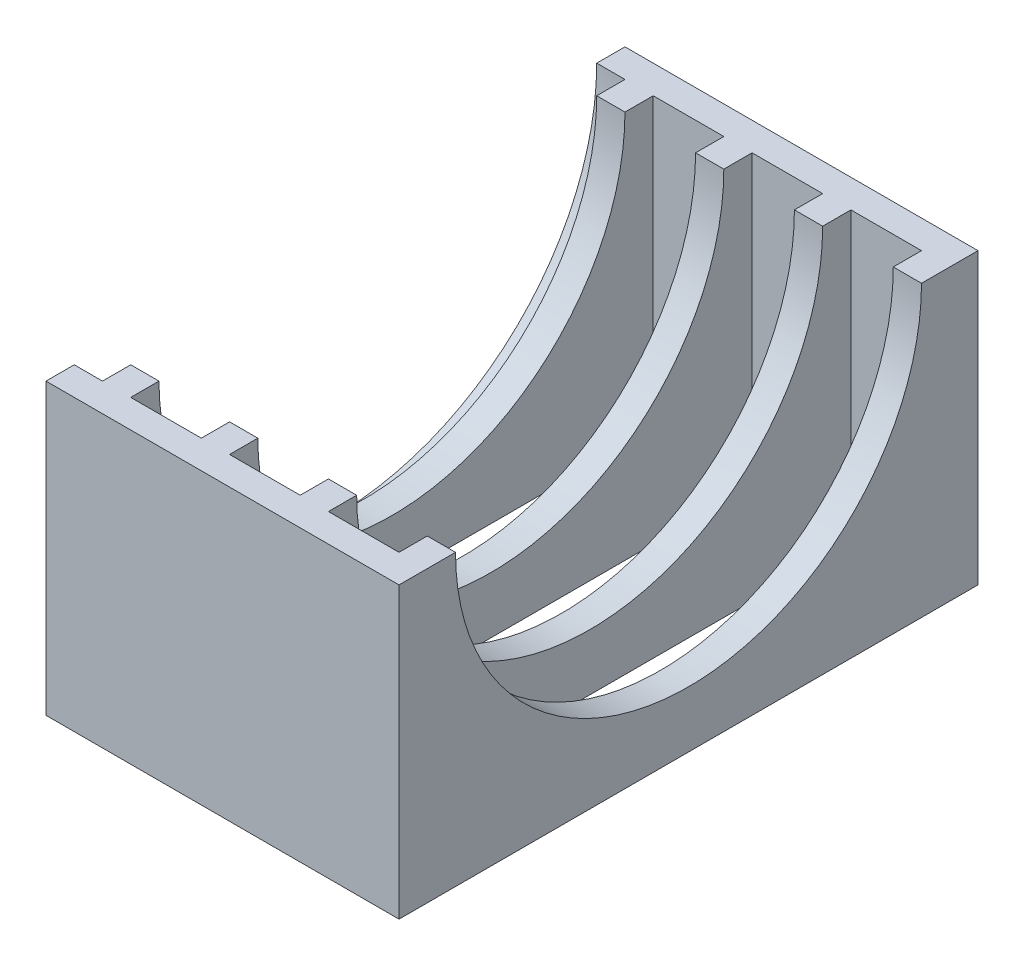
ISO-10303-21;
HEADER;
FILE_DESCRIPTION(('STEP AP214'),'2;1');
FILE_NAME('part.step','',(''),(''),'','','');
FILE_SCHEMA(('AUTOMOTIVE_DESIGN { 1 0 10303 214 1 1 1 1 }'));
ENDSEC;
DATA;
#1=APPLICATION_CONTEXT('core data for automotive mechanical design processes');
#2=APPLICATION_PROTOCOL_DEFINITION('international standard','automotive_design',2000,#1);
#3=PRODUCT_CONTEXT('',#1,'mechanical');
#4=PRODUCT('Part','Part','',(#3));
#5=PRODUCT_RELATED_PRODUCT_CATEGORY('part','',(#4));
#6=PRODUCT_DEFINITION_FORMATION('','',#4);
#7=PRODUCT_DEFINITION_CONTEXT('part definition',#1,'design');
#8=PRODUCT_DEFINITION('design','',#6,#7);
#9=PRODUCT_DEFINITION_SHAPE('','',#8);
#10=(LENGTH_UNIT() NAMED_UNIT(*) SI_UNIT(.MILLI.,.METRE.));
#11=(NAMED_UNIT(*) PLANE_ANGLE_UNIT() SI_UNIT($,.RADIAN.));
#12=(NAMED_UNIT(*) SI_UNIT($,.STERADIAN.) SOLID_ANGLE_UNIT());
#13=UNCERTAINTY_MEASURE_WITH_UNIT(LENGTH_MEASURE(1.E-05),#10,'distance_accuracy_value','');
#14=(GEOMETRIC_REPRESENTATION_CONTEXT(3) GLOBAL_UNCERTAINTY_ASSIGNED_CONTEXT((#13)) GLOBAL_UNIT_ASSIGNED_CONTEXT((#10,
#11,#12)) REPRESENTATION_CONTEXT('',''));
#15=CARTESIAN_POINT('',(0.,0.,0.));
#16=DIRECTION('',(0.,0.,1.));
#17=DIRECTION('',(1.,0.,0.));
#18=AXIS2_PLACEMENT_3D('',#15,#16,#17);
#19=CARTESIAN_POINT('',(0.,20.5,0.));
#20=DIRECTION('',(0.,1.,0.));
#21=DIRECTION('',(0.,0.,1.));
#22=AXIS2_PLACEMENT_3D('',#19,#20,#21);
#23=PLANE('',#22);
#24=DIRECTION('',(1.,0.,0.));
#25=VECTOR('',#24,1.);
#26=CARTESIAN_POINT('',(2.,20.5,-4.));
#27=LINE('',#26,#25);
#28=CARTESIAN_POINT('',(2.,20.5,-4.));
#29=VERTEX_POINT('',#28);
#30=CARTESIAN_POINT('',(4.,20.5,-4.));
#31=VERTEX_POINT('',#30);
#32=EDGE_CURVE('E273',#29,#31,#27,.T.);
#33=ORIENTED_EDGE('',*,*,#32,.F.);
#34=DIRECTION('',(0.,0.,1.));
#35=VECTOR('',#34,1.);
#36=CARTESIAN_POINT('',(2.,20.5,0.));
#37=LINE('',#36,#35);
#38=CARTESIAN_POINT('',(2.,20.5,-2.));
#39=VERTEX_POINT('',#38);
#40=EDGE_CURVE('E378',#29,#39,#37,.T.);
#41=ORIENTED_EDGE('',*,*,#40,.T.);
#42=DIRECTION('',(-1.,0.,0.));
#43=VECTOR('',#42,1.);
#44=CARTESIAN_POINT('',(2.,20.5,-2.));
#45=LINE('',#44,#43);
#46=CARTESIAN_POINT('',(0.,20.5,-2.));
#47=VERTEX_POINT('',#46);
#48=EDGE_CURVE('E382',#47,#39,#45,.F.);
#49=ORIENTED_EDGE('',*,*,#48,.F.);
#50=DIRECTION('',(0.,0.,1.));
#51=VECTOR('',#50,1.);
#52=CARTESIAN_POINT('',(0.,20.5,-41.));
#53=LINE('',#52,#51);
#54=CARTESIAN_POINT('',(0.,20.5,0.));
#55=VERTEX_POINT('',#54);
#56=EDGE_CURVE('E340',#47,#55,#53,.T.);
#57=ORIENTED_EDGE('',*,*,#56,.T.);
#58=DIRECTION('',(1.,0.,0.));
#59=VECTOR('',#58,1.);
#60=CARTESIAN_POINT('',(0.,20.5,0.));
#61=LINE('',#60,#59);
#62=CARTESIAN_POINT('',(25.,20.5,0.));
#63=VERTEX_POINT('',#62);
#64=EDGE_CURVE('E333',#55,#63,#61,.T.);
#65=ORIENTED_EDGE('',*,*,#64,.T.);
#66=DIRECTION('',(0.,0.,-1.));
#67=VECTOR('',#66,1.);
#68=CARTESIAN_POINT('',(25.,20.5,-41.));
#69=LINE('',#68,#67);
#70=CARTESIAN_POINT('',(25.,20.5,-4.));
#71=VERTEX_POINT('',#70);
#72=EDGE_CURVE('E351',#63,#71,#69,.T.);
#73=ORIENTED_EDGE('',*,*,#72,.T.);
#74=CARTESIAN_POINT('',(23.,20.5,-4.));
#75=VERTEX_POINT('',#74);
#76=EDGE_CURVE('E268',#75,#71,#27,.T.);
#77=ORIENTED_EDGE('',*,*,#76,.F.);
#78=DIRECTION('',(0.,0.,1.));
#79=VECTOR('',#78,1.);
#80=CARTESIAN_POINT('',(23.,20.5,0.));
#81=LINE('',#80,#79);
#82=CARTESIAN_POINT('',(23.,20.5,-2.));
#83=VERTEX_POINT('',#82);
#84=EDGE_CURVE('E290',#75,#83,#81,.T.);
#85=ORIENTED_EDGE('',*,*,#84,.T.);
#86=DIRECTION('',(-1.,0.,0.));
#87=VECTOR('',#86,1.);
#88=CARTESIAN_POINT('',(0.,20.5,-2.));
#89=LINE('',#88,#87);
#90=CARTESIAN_POINT('',(18.,20.5,-2.));
#91=VERTEX_POINT('',#90);
#92=EDGE_CURVE('E337',#83,#91,#89,.T.);
#93=ORIENTED_EDGE('',*,*,#92,.T.);
#94=DIRECTION('',(0.,0.,1.));
#95=VECTOR('',#94,1.);
#96=CARTESIAN_POINT('',(18.,20.5,0.));
#97=LINE('',#96,#95);
#98=CARTESIAN_POINT('',(18.,20.5,-4.));
#99=VERTEX_POINT('',#98);
#100=EDGE_CURVE('E299',#99,#91,#97,.T.);
#101=ORIENTED_EDGE('',*,*,#100,.F.);
#102=CARTESIAN_POINT('',(16.,20.5,-4.));
#103=VERTEX_POINT('',#102);
#104=EDGE_CURVE('E274',#103,#99,#27,.T.);
#105=ORIENTED_EDGE('',*,*,#104,.F.);
#106=DIRECTION('',(0.,0.,-1.));
#107=VECTOR('',#106,1.);
#108=CARTESIAN_POINT('',(16.,20.5,0.));
#109=LINE('',#108,#107);
#110=CARTESIAN_POINT('',(16.,20.5,-2.));
#111=VERTEX_POINT('',#110);
#112=EDGE_CURVE('E304',#111,#103,#109,.T.);
#113=ORIENTED_EDGE('',*,*,#112,.F.);
#114=CARTESIAN_POINT('',(11.,20.5,-2.));
#115=VERTEX_POINT('',#114);
#116=EDGE_CURVE('E341',#111,#115,#89,.T.);
#117=ORIENTED_EDGE('',*,*,#116,.T.);
#118=DIRECTION('',(0.,0.,1.));
#119=VECTOR('',#118,1.);
#120=CARTESIAN_POINT('',(11.,20.5,0.));
#121=LINE('',#120,#119);
#122=CARTESIAN_POINT('',(11.,20.5,-4.));
#123=VERTEX_POINT('',#122);
#124=EDGE_CURVE('E217',#123,#115,#121,.T.);
#125=ORIENTED_EDGE('',*,*,#124,.F.);
#126=CARTESIAN_POINT('',(9.00000000000001,20.5,-4.));
#127=VERTEX_POINT('',#126);
#128=EDGE_CURVE('E285',#127,#123,#27,.T.);
#129=ORIENTED_EDGE('',*,*,#128,.F.);
#130=DIRECTION('',(0.,0.,1.));
#131=VECTOR('',#130,1.);
#132=CARTESIAN_POINT('',(9.00000000000001,20.5,0.));
#133=LINE('',#132,#131);
#134=CARTESIAN_POINT('',(9.00000000000001,20.5,-2.));
#135=VERTEX_POINT('',#134);
#136=EDGE_CURVE('E317',#127,#135,#133,.T.);
#137=ORIENTED_EDGE('',*,*,#136,.T.);
#138=CARTESIAN_POINT('',(4.,20.5,-2.));
#139=VERTEX_POINT('',#138);
#140=EDGE_CURVE('E336',#135,#139,#89,.T.);
#141=ORIENTED_EDGE('',*,*,#140,.T.);
#142=DIRECTION('',(0.,0.,1.));
#143=VECTOR('',#142,1.);
#144=CARTESIAN_POINT('',(4.00000000000001,20.5,0.));
#145=LINE('',#144,#143);
#146=EDGE_CURVE('E325',#31,#139,#145,.T.);
#147=ORIENTED_EDGE('',*,*,#146,.F.);
#148=EDGE_LOOP('',(#33,#41,#49,#57,#65,#73,#77,#85,#93,#101,#105,#113,#117,#125,#129,#137,#141,#147));
#149=FACE_BOUND('',#148,.T.);
#150=ADVANCED_FACE('F34',(#149),#23,.T.);
#151=CARTESIAN_POINT('',(0.,20.5,-39.));
#152=DIRECTION('',(0.,0.,-1.));
#153=DIRECTION('',(-1.,0.,0.));
#154=AXIS2_PLACEMENT_3D('',#151,#152,#153);
#155=PLANE('',#154);
#156=DIRECTION('',(0.,-1.,0.));
#157=VECTOR('',#156,1.);
#158=CARTESIAN_POINT('',(23.,20.5,-39.));
#159=LINE('',#158,#157);
#160=CARTESIAN_POINT('',(23.,20.5,-39.));
#161=VERTEX_POINT('',#160);
#162=CARTESIAN_POINT('',(23.,0.,-39.));
#163=VERTEX_POINT('',#162);
#164=EDGE_CURVE('E297',#161,#163,#159,.T.);
#165=ORIENTED_EDGE('',*,*,#164,.F.);
#166=DIRECTION('',(1.,0.,0.));
#167=VECTOR('',#166,1.);
#168=CARTESIAN_POINT('',(0.,20.5,-39.));
#169=LINE('',#168,#167);
#170=CARTESIAN_POINT('',(18.,20.5,-39.));
#171=VERTEX_POINT('',#170);
#172=EDGE_CURVE('E345',#171,#161,#169,.T.);
#173=ORIENTED_EDGE('',*,*,#172,.F.);
#174=DIRECTION('',(0.,-1.,0.));
#175=VECTOR('',#174,1.);
#176=CARTESIAN_POINT('',(18.,20.5,-39.));
#177=LINE('',#176,#175);
#178=CARTESIAN_POINT('',(18.,0.,-39.));
#179=VERTEX_POINT('',#178);
#180=EDGE_CURVE('E312',#171,#179,#177,.T.);
#181=ORIENTED_EDGE('',*,*,#180,.T.);
#182=DIRECTION('',(-1.,0.,0.));
#183=VECTOR('',#182,1.);
#184=CARTESIAN_POINT('',(18.,0.,-39.));
#185=LINE('',#184,#183);
#186=EDGE_CURVE('E233',#163,#179,#185,.T.);
#187=ORIENTED_EDGE('',*,*,#186,.F.);
#188=EDGE_LOOP('',(#165,#173,#181,#187));
#189=FACE_BOUND('',#188,.T.);
#190=ADVANCED_FACE('F454',(#189),#155,.F.);
#191=CARTESIAN_POINT('',(0.,20.5,-2.));
#192=DIRECTION('',(0.,0.,1.));
#193=DIRECTION('',(1.,0.,0.));
#194=AXIS2_PLACEMENT_3D('',#191,#192,#193);
#195=PLANE('',#194);
#196=DIRECTION('',(0.,-1.,0.));
#197=VECTOR('',#196,1.);
#198=CARTESIAN_POINT('',(23.,20.5,-2.));
#199=LINE('',#198,#197);
#200=CARTESIAN_POINT('',(23.,0.,-2.));
#201=VERTEX_POINT('',#200);
#202=EDGE_CURVE('E57',#83,#201,#199,.T.);
#203=ORIENTED_EDGE('',*,*,#202,.T.);
#204=DIRECTION('',(1.,0.,0.));
#205=VECTOR('',#204,1.);
#206=CARTESIAN_POINT('',(18.,0.,-2.));
#207=LINE('',#206,#205);
#208=CARTESIAN_POINT('',(18.,0.,-2.));
#209=VERTEX_POINT('',#208);
#210=EDGE_CURVE('E245',#209,#201,#207,.T.);
#211=ORIENTED_EDGE('',*,*,#210,.F.);
#212=DIRECTION('',(0.,-1.,0.));
#213=VECTOR('',#212,1.);
#214=CARTESIAN_POINT('',(18.,20.5,-2.));
#215=LINE('',#214,#213);
#216=EDGE_CURVE('E307',#91,#209,#215,.T.);
#217=ORIENTED_EDGE('',*,*,#216,.F.);
#218=ORIENTED_EDGE('',*,*,#92,.F.);
#219=EDGE_LOOP('',(#203,#211,#217,#218));
#220=FACE_BOUND('',#219,.T.);
#221=ADVANCED_FACE('F459',(#220),#195,.F.);
#222=DIRECTION('',(0.,-1.,0.));
#223=VECTOR('',#222,1.);
#224=CARTESIAN_POINT('',(9.00000000000001,20.5,-39.));
#225=LINE('',#224,#223);
#226=CARTESIAN_POINT('',(9.00000000000001,20.5,-39.));
#227=VERTEX_POINT('',#226);
#228=CARTESIAN_POINT('',(9.00000000000001,0.,-39.));
#229=VERTEX_POINT('',#228);
#230=EDGE_CURVE('E321',#227,#229,#225,.T.);
#231=ORIENTED_EDGE('',*,*,#230,.F.);
#232=CARTESIAN_POINT('',(4.,20.5,-39.));
#233=VERTEX_POINT('',#232);
#234=EDGE_CURVE('E346',#233,#227,#169,.T.);
#235=ORIENTED_EDGE('',*,*,#234,.F.);
#236=DIRECTION('',(0.,-1.,0.));
#237=VECTOR('',#236,1.);
#238=CARTESIAN_POINT('',(4.,20.5,-39.));
#239=LINE('',#238,#237);
#240=CARTESIAN_POINT('',(4.,0.,-39.));
#241=VERTEX_POINT('',#240);
#242=EDGE_CURVE('E331',#233,#241,#239,.T.);
#243=ORIENTED_EDGE('',*,*,#242,.T.);
#244=DIRECTION('',(-1.,0.,0.));
#245=VECTOR('',#244,1.);
#246=CARTESIAN_POINT('',(4.,0.,-39.));
#247=LINE('',#246,#245);
#248=EDGE_CURVE('E258',#229,#241,#247,.T.);
#249=ORIENTED_EDGE('',*,*,#248,.F.);
#250=EDGE_LOOP('',(#231,#235,#243,#249));
#251=FACE_BOUND('',#250,.T.);
#252=ADVANCED_FACE('F429',(#251),#155,.F.);
#253=DIRECTION('',(0.,-1.,0.));
#254=VECTOR('',#253,1.);
#255=CARTESIAN_POINT('',(9.00000000000001,20.5,-2.));
#256=LINE('',#255,#254);
#257=CARTESIAN_POINT('',(9.00000000000001,0.,-2.));
#258=VERTEX_POINT('',#257);
#259=EDGE_CURVE('E219',#135,#258,#256,.T.);
#260=ORIENTED_EDGE('',*,*,#259,.T.);
#261=DIRECTION('',(1.,0.,0.));
#262=VECTOR('',#261,1.);
#263=CARTESIAN_POINT('',(4.,0.,-2.));
#264=LINE('',#263,#262);
#265=CARTESIAN_POINT('',(4.,0.,-2.));
#266=VERTEX_POINT('',#265);
#267=EDGE_CURVE('E252',#266,#258,#264,.T.);
#268=ORIENTED_EDGE('',*,*,#267,.F.);
#269=DIRECTION('',(0.,-1.,0.));
#270=VECTOR('',#269,1.);
#271=CARTESIAN_POINT('',(4.,20.5,-2.));
#272=LINE('',#271,#270);
#273=EDGE_CURVE('E329',#139,#266,#272,.T.);
#274=ORIENTED_EDGE('',*,*,#273,.F.);
#275=ORIENTED_EDGE('',*,*,#140,.F.);
#276=EDGE_LOOP('',(#260,#268,#274,#275));
#277=FACE_BOUND('',#276,.T.);
#278=ADVANCED_FACE('F469',(#277),#195,.F.);
#279=CARTESIAN_POINT('',(0.,2.,0.));
#280=DIRECTION('',(1.,0.,0.));
#281=DIRECTION('',(0.,0.,-1.));
#282=AXIS2_PLACEMENT_3D('',#279,#280,#281);
#283=PLANE('',#282);
#284=ORIENTED_EDGE('',*,*,#56,.F.);
#285=CARTESIAN_POINT('',(0.,20.5,-20.5));
#286=DIRECTION('',(-1.,0.,0.));
#287=DIRECTION('',(0.,0.,1.));
#288=AXIS2_PLACEMENT_3D('',#285,#286,#287);
#289=CIRCLE('',#288,18.5);
#290=CARTESIAN_POINT('',(0.,20.5,-39.));
#291=VERTEX_POINT('',#290);
#292=EDGE_CURVE('E291',#291,#47,#289,.T.);
#293=ORIENTED_EDGE('',*,*,#292,.F.);
#294=CARTESIAN_POINT('',(0.,20.5,-41.));
#295=VERTEX_POINT('',#294);
#296=EDGE_CURVE('E342',#295,#291,#53,.T.);
#297=ORIENTED_EDGE('',*,*,#296,.F.);
#298=DIRECTION('',(0.,-1.,0.));
#299=VECTOR('',#298,1.);
#300=CARTESIAN_POINT('',(0.,2.,-41.));
#301=LINE('',#300,#299);
#302=CARTESIAN_POINT('',(0.,0.,-41.));
#303=VERTEX_POINT('',#302);
#304=EDGE_CURVE('E366',#295,#303,#301,.T.);
#305=ORIENTED_EDGE('',*,*,#304,.T.);
#306=DIRECTION('',(0.,0.,1.));
#307=VECTOR('',#306,1.);
#308=CARTESIAN_POINT('',(0.,0.,0.));
#309=LINE('',#308,#307);
#310=CARTESIAN_POINT('',(0.,0.,0.));
#311=VERTEX_POINT('',#310);
#312=EDGE_CURVE('E357',#303,#311,#309,.T.);
#313=ORIENTED_EDGE('',*,*,#312,.T.);
#314=DIRECTION('',(0.,-1.,0.));
#315=VECTOR('',#314,1.);
#316=CARTESIAN_POINT('',(0.,2.,0.));
#317=LINE('',#316,#315);
#318=EDGE_CURVE('E375',#55,#311,#317,.T.);
#319=ORIENTED_EDGE('',*,*,#318,.F.);
#320=EDGE_LOOP('',(#284,#293,#297,#305,#313,#319));
#321=FACE_BOUND('',#320,.T.);
#322=ADVANCED_FACE('F36',(#321),#283,.F.);
#323=CARTESIAN_POINT('',(0.,2.,0.));
#324=DIRECTION('',(0.,0.,-1.));
#325=DIRECTION('',(-1.,0.,0.));
#326=AXIS2_PLACEMENT_3D('',#323,#324,#325);
#327=PLANE('',#326);
#328=DIRECTION('',(1.,0.,0.));
#329=VECTOR('',#328,1.);
#330=CARTESIAN_POINT('',(0.,0.,0.));
#331=LINE('',#330,#329);
#332=CARTESIAN_POINT('',(25.,0.,0.));
#333=VERTEX_POINT('',#332);
#334=EDGE_CURVE('E360',#311,#333,#331,.T.);
#335=ORIENTED_EDGE('',*,*,#334,.T.);
#336=DIRECTION('',(0.,-1.,0.));
#337=VECTOR('',#336,1.);
#338=CARTESIAN_POINT('',(25.,2.,0.));
#339=LINE('',#338,#337);
#340=EDGE_CURVE('E372',#63,#333,#339,.T.);
#341=ORIENTED_EDGE('',*,*,#340,.F.);
#342=ORIENTED_EDGE('',*,*,#64,.F.);
#343=ORIENTED_EDGE('',*,*,#318,.T.);
#344=EDGE_LOOP('',(#335,#341,#342,#343));
#345=FACE_BOUND('',#344,.T.);
#346=ADVANCED_FACE('F409',(#345),#327,.F.);
#347=CARTESIAN_POINT('',(25.,2.,0.));
#348=DIRECTION('',(-1.,0.,0.));
#349=DIRECTION('',(0.,0.,1.));
#350=AXIS2_PLACEMENT_3D('',#347,#348,#349);
#351=PLANE('',#350);
#352=CARTESIAN_POINT('',(25.,20.5,-37.));
#353=VERTEX_POINT('',#352);
#354=CARTESIAN_POINT('',(25.,20.5,-41.));
#355=VERTEX_POINT('',#354);
#356=EDGE_CURVE('E349',#353,#355,#69,.T.);
#357=ORIENTED_EDGE('',*,*,#356,.F.);
#358=CARTESIAN_POINT('',(25.,20.5,-20.5));
#359=DIRECTION('',(1.,0.,0.));
#360=DIRECTION('',(0.,0.,-1.));
#361=AXIS2_PLACEMENT_3D('',#358,#359,#360);
#362=CIRCLE('',#361,16.5);
#363=EDGE_CURVE('E261',#71,#353,#362,.T.);
#364=ORIENTED_EDGE('',*,*,#363,.F.);
#365=ORIENTED_EDGE('',*,*,#72,.F.);
#366=ORIENTED_EDGE('',*,*,#340,.T.);
#367=DIRECTION('',(0.,0.,-1.));
#368=VECTOR('',#367,1.);
#369=CARTESIAN_POINT('',(25.,0.,0.));
#370=LINE('',#369,#368);
#371=CARTESIAN_POINT('',(25.,0.,-41.));
#372=VERTEX_POINT('',#371);
#373=EDGE_CURVE('E362',#333,#372,#370,.T.);
#374=ORIENTED_EDGE('',*,*,#373,.T.);
#375=DIRECTION('',(0.,-1.,0.));
#376=VECTOR('',#375,1.);
#377=CARTESIAN_POINT('',(25.,2.,-41.));
#378=LINE('',#377,#376);
#379=EDGE_CURVE('E369',#355,#372,#378,.T.);
#380=ORIENTED_EDGE('',*,*,#379,.F.);
#381=EDGE_LOOP('',(#357,#364,#365,#366,#374,#380));
#382=FACE_BOUND('',#381,.T.);
#383=ADVANCED_FACE('F661',(#382),#351,.F.);
#384=CARTESIAN_POINT('',(0.,2.,-41.));
#385=DIRECTION('',(0.,0.,1.));
#386=DIRECTION('',(1.,0.,0.));
#387=AXIS2_PLACEMENT_3D('',#384,#385,#386);
#388=PLANE('',#387);
#389=DIRECTION('',(-1.,0.,0.));
#390=VECTOR('',#389,1.);
#391=CARTESIAN_POINT('',(0.,0.,-41.));
#392=LINE('',#391,#390);
#393=EDGE_CURVE('E364',#372,#303,#392,.T.);
#394=ORIENTED_EDGE('',*,*,#393,.T.);
#395=ORIENTED_EDGE('',*,*,#304,.F.);
#396=DIRECTION('',(-1.,0.,0.));
#397=VECTOR('',#396,1.);
#398=CARTESIAN_POINT('',(0.,20.5,-41.));
#399=LINE('',#398,#397);
#400=EDGE_CURVE('E354',#355,#295,#399,.T.);
#401=ORIENTED_EDGE('',*,*,#400,.F.);
#402=ORIENTED_EDGE('',*,*,#379,.T.);
#403=EDGE_LOOP('',(#394,#395,#401,#402));
#404=FACE_BOUND('',#403,.T.);
#405=ADVANCED_FACE('F401',(#404),#388,.F.);
#406=CARTESIAN_POINT('',(0.,0.,0.));
#407=DIRECTION('',(0.,-1.,0.));
#408=DIRECTION('',(0.,0.,-1.));
#409=AXIS2_PLACEMENT_3D('',#406,#407,#408);
#410=PLANE('',#409);
#411=DIRECTION('',(0.,0.,1.));
#412=VECTOR('',#411,1.);
#413=CARTESIAN_POINT('',(11.,0.,-39.));
#414=LINE('',#413,#412);
#415=CARTESIAN_POINT('',(11.,0.,-39.));
#416=VERTEX_POINT('',#415);
#417=CARTESIAN_POINT('',(11.,0.,-2.));
#418=VERTEX_POINT('',#417);
#419=EDGE_CURVE('E214',#416,#418,#414,.T.);
#420=ORIENTED_EDGE('',*,*,#419,.T.);
#421=DIRECTION('',(1.,0.,0.));
#422=VECTOR('',#421,1.);
#423=CARTESIAN_POINT('',(11.,0.,-2.));
#424=LINE('',#423,#422);
#425=CARTESIAN_POINT('',(16.,0.,-2.));
#426=VERTEX_POINT('',#425);
#427=EDGE_CURVE('E223',#418,#426,#424,.T.);
#428=ORIENTED_EDGE('',*,*,#427,.T.);
#429=DIRECTION('',(0.,0.,-1.));
#430=VECTOR('',#429,1.);
#431=CARTESIAN_POINT('',(16.,0.,-39.));
#432=LINE('',#431,#430);
#433=CARTESIAN_POINT('',(16.,0.,-39.));
#434=VERTEX_POINT('',#433);
#435=EDGE_CURVE('E227',#426,#434,#432,.T.);
#436=ORIENTED_EDGE('',*,*,#435,.T.);
#437=DIRECTION('',(-1.,0.,0.));
#438=VECTOR('',#437,1.);
#439=CARTESIAN_POINT('',(11.,0.,-39.));
#440=LINE('',#439,#438);
#441=EDGE_CURVE('E232',#434,#416,#440,.T.);
#442=ORIENTED_EDGE('',*,*,#441,.T.);
#443=EDGE_LOOP('',(#420,#428,#436,#442));
#444=FACE_BOUND('',#443,.T.);
#445=DIRECTION('',(0.,0.,1.));
#446=VECTOR('',#445,1.);
#447=CARTESIAN_POINT('',(18.,0.,-39.));
#448=LINE('',#447,#446);
#449=EDGE_CURVE('E242',#179,#209,#448,.T.);
#450=ORIENTED_EDGE('',*,*,#449,.T.);
#451=ORIENTED_EDGE('',*,*,#210,.T.);
#452=DIRECTION('',(0.,0.,-1.));
#453=VECTOR('',#452,1.);
#454=CARTESIAN_POINT('',(23.,0.,-39.));
#455=LINE('',#454,#453);
#456=EDGE_CURVE('E236',#201,#163,#455,.T.);
#457=ORIENTED_EDGE('',*,*,#456,.T.);
#458=ORIENTED_EDGE('',*,*,#186,.T.);
#459=EDGE_LOOP('',(#450,#451,#457,#458));
#460=FACE_BOUND('',#459,.T.);
#461=DIRECTION('',(0.,0.,1.));
#462=VECTOR('',#461,1.);
#463=CARTESIAN_POINT('',(4.,0.,-39.));
#464=LINE('',#463,#462);
#465=EDGE_CURVE('E241',#241,#266,#464,.T.);
#466=ORIENTED_EDGE('',*,*,#465,.T.);
#467=ORIENTED_EDGE('',*,*,#267,.T.);
#468=DIRECTION('',(0.,0.,-1.));
#469=VECTOR('',#468,1.);
#470=CARTESIAN_POINT('',(9.00000000000001,0.,-39.));
#471=LINE('',#470,#469);
#472=EDGE_CURVE('E255',#258,#229,#471,.T.);
#473=ORIENTED_EDGE('',*,*,#472,.T.);
#474=ORIENTED_EDGE('',*,*,#248,.T.);
#475=EDGE_LOOP('',(#466,#467,#473,#474));
#476=FACE_BOUND('',#475,.T.);
#477=ORIENTED_EDGE('',*,*,#312,.F.);
#478=ORIENTED_EDGE('',*,*,#393,.F.);
#479=ORIENTED_EDGE('',*,*,#373,.F.);
#480=ORIENTED_EDGE('',*,*,#334,.F.);
#481=EDGE_LOOP('',(#477,#478,#479,#480));
#482=FACE_BOUND('',#481,.T.);
#483=ADVANCED_FACE('F229',(#444,#460,#476,#482),#410,.T.);
#484=DIRECTION('',(0.,-1.,0.));
#485=VECTOR('',#484,1.);
#486=CARTESIAN_POINT('',(11.,20.5,-39.));
#487=LINE('',#486,#485);
#488=CARTESIAN_POINT('',(11.,20.5,-39.));
#489=VERTEX_POINT('',#488);
#490=EDGE_CURVE('E323',#489,#416,#487,.T.);
#491=ORIENTED_EDGE('',*,*,#490,.T.);
#492=ORIENTED_EDGE('',*,*,#441,.F.);
#493=DIRECTION('',(0.,-1.,0.));
#494=VECTOR('',#493,1.);
#495=CARTESIAN_POINT('',(16.,20.5,-39.));
#496=LINE('',#495,#494);
#497=CARTESIAN_POINT('',(16.,20.5,-39.));
#498=VERTEX_POINT('',#497);
#499=EDGE_CURVE('E310',#498,#434,#496,.T.);
#500=ORIENTED_EDGE('',*,*,#499,.F.);
#501=EDGE_CURVE('E350',#489,#498,#169,.T.);
#502=ORIENTED_EDGE('',*,*,#501,.F.);
#503=EDGE_LOOP('',(#491,#492,#500,#502));
#504=FACE_BOUND('',#503,.T.);
#505=ADVANCED_FACE('F462',(#504),#155,.F.);
#506=DIRECTION('',(1.,0.,0.));
#507=VECTOR('',#506,1.);
#508=CARTESIAN_POINT('',(2.,20.5,-37.));
#509=LINE('',#508,#507);
#510=CARTESIAN_POINT('',(23.,20.5,-37.));
#511=VERTEX_POINT('',#510);
#512=EDGE_CURVE('E266',#353,#511,#509,.F.);
#513=ORIENTED_EDGE('',*,*,#512,.F.);
#514=ORIENTED_EDGE('',*,*,#356,.T.);
#515=ORIENTED_EDGE('',*,*,#400,.T.);
#516=ORIENTED_EDGE('',*,*,#296,.T.);
#517=DIRECTION('',(-1.,0.,0.));
#518=VECTOR('',#517,1.);
#519=CARTESIAN_POINT('',(2.,20.5,-39.));
#520=LINE('',#519,#518);
#521=CARTESIAN_POINT('',(2.,20.5,-39.));
#522=VERTEX_POINT('',#521);
#523=EDGE_CURVE('E42',#522,#291,#520,.T.);
#524=ORIENTED_EDGE('',*,*,#523,.F.);
#525=CARTESIAN_POINT('',(2.,20.5,-37.));
#526=VERTEX_POINT('',#525);
#527=EDGE_CURVE('E379',#522,#526,#37,.T.);
#528=ORIENTED_EDGE('',*,*,#527,.T.);
#529=CARTESIAN_POINT('',(4.,20.5,-37.));
#530=VERTEX_POINT('',#529);
#531=EDGE_CURVE('E269',#530,#526,#509,.F.);
#532=ORIENTED_EDGE('',*,*,#531,.F.);
#533=EDGE_CURVE('E326',#233,#530,#145,.T.);
#534=ORIENTED_EDGE('',*,*,#533,.F.);
#535=ORIENTED_EDGE('',*,*,#234,.T.);
#536=CARTESIAN_POINT('',(9.,20.5,-37.));
#537=VERTEX_POINT('',#536);
#538=EDGE_CURVE('E220',#227,#537,#133,.T.);
#539=ORIENTED_EDGE('',*,*,#538,.T.);
#540=CARTESIAN_POINT('',(11.,20.5,-37.));
#541=VERTEX_POINT('',#540);
#542=EDGE_CURVE('E281',#541,#537,#509,.F.);
#543=ORIENTED_EDGE('',*,*,#542,.F.);
#544=EDGE_CURVE('E314',#489,#541,#121,.T.);
#545=ORIENTED_EDGE('',*,*,#544,.F.);
#546=ORIENTED_EDGE('',*,*,#501,.T.);
#547=CARTESIAN_POINT('',(16.,20.5,-37.));
#548=VERTEX_POINT('',#547);
#549=EDGE_CURVE('E303',#548,#498,#109,.T.);
#550=ORIENTED_EDGE('',*,*,#549,.F.);
#551=CARTESIAN_POINT('',(18.,20.5,-37.));
#552=VERTEX_POINT('',#551);
#553=EDGE_CURVE('E270',#552,#548,#509,.F.);
#554=ORIENTED_EDGE('',*,*,#553,.F.);
#555=EDGE_CURVE('E300',#171,#552,#97,.T.);
#556=ORIENTED_EDGE('',*,*,#555,.F.);
#557=ORIENTED_EDGE('',*,*,#172,.T.);
#558=EDGE_CURVE('E293',#161,#511,#81,.T.);
#559=ORIENTED_EDGE('',*,*,#558,.T.);
#560=EDGE_LOOP('',(#513,#514,#515,#516,#524,#528,#532,#534,#535,#539,#543,#545,#546,#550,#554,
#556,#557,#559));
#561=FACE_BOUND('',#560,.T.);
#562=ADVANCED_FACE('F396',(#561),#23,.T.);
#563=ORIENTED_EDGE('',*,*,#116,.F.);
#564=DIRECTION('',(0.,-1.,0.));
#565=VECTOR('',#564,1.);
#566=CARTESIAN_POINT('',(16.,20.5,-2.));
#567=LINE('',#566,#565);
#568=EDGE_CURVE('E49',#111,#426,#567,.T.);
#569=ORIENTED_EDGE('',*,*,#568,.T.);
#570=ORIENTED_EDGE('',*,*,#427,.F.);
#571=DIRECTION('',(0.,-1.,0.));
#572=VECTOR('',#571,1.);
#573=CARTESIAN_POINT('',(11.,20.5,-2.));
#574=LINE('',#573,#572);
#575=EDGE_CURVE('E210',#115,#418,#574,.T.);
#576=ORIENTED_EDGE('',*,*,#575,.F.);
#577=EDGE_LOOP('',(#563,#569,#570,#576));
#578=FACE_BOUND('',#577,.T.);
#579=ADVANCED_FACE('F224',(#578),#195,.F.);
#580=CARTESIAN_POINT('',(4.00000000000001,20.5,0.));
#581=DIRECTION('',(1.,0.,0.));
#582=DIRECTION('',(0.,0.,-1.));
#583=AXIS2_PLACEMENT_3D('',#580,#581,#582);
#584=PLANE('',#583);
#585=CARTESIAN_POINT('',(4.,20.5,-20.5));
#586=DIRECTION('',(1.,0.,0.));
#587=DIRECTION('',(0.,0.,-1.));
#588=AXIS2_PLACEMENT_3D('',#585,#586,#587);
#589=CIRCLE('',#588,16.5);
#590=EDGE_CURVE('E284',#31,#530,#589,.T.);
#591=ORIENTED_EDGE('',*,*,#590,.F.);
#592=ORIENTED_EDGE('',*,*,#146,.T.);
#593=ORIENTED_EDGE('',*,*,#273,.T.);
#594=ORIENTED_EDGE('',*,*,#465,.F.);
#595=ORIENTED_EDGE('',*,*,#242,.F.);
#596=ORIENTED_EDGE('',*,*,#533,.T.);
#597=EDGE_LOOP('',(#591,#592,#593,#594,#595,#596));
#598=FACE_BOUND('',#597,.T.);
#599=ADVANCED_FACE('F424',(#598),#584,.T.);
#600=CARTESIAN_POINT('',(11.,20.5,0.));
#601=DIRECTION('',(1.,0.,0.));
#602=DIRECTION('',(0.,0.,-1.));
#603=AXIS2_PLACEMENT_3D('',#600,#601,#602);
#604=PLANE('',#603);
#605=CARTESIAN_POINT('',(11.,20.5,-20.5));
#606=DIRECTION('',(1.,0.,0.));
#607=DIRECTION('',(0.,0.,-1.));
#608=AXIS2_PLACEMENT_3D('',#605,#606,#607);
#609=CIRCLE('',#608,16.5);
#610=EDGE_CURVE('E282',#123,#541,#609,.T.);
#611=ORIENTED_EDGE('',*,*,#610,.F.);
#612=ORIENTED_EDGE('',*,*,#124,.T.);
#613=ORIENTED_EDGE('',*,*,#575,.T.);
#614=ORIENTED_EDGE('',*,*,#419,.F.);
#615=ORIENTED_EDGE('',*,*,#490,.F.);
#616=ORIENTED_EDGE('',*,*,#544,.T.);
#617=EDGE_LOOP('',(#611,#612,#613,#614,#615,#616));
#618=FACE_BOUND('',#617,.T.);
#619=ADVANCED_FACE('F212',(#618),#604,.T.);
#620=CARTESIAN_POINT('',(9.00000000000001,20.5,0.));
#621=DIRECTION('',(1.,0.,0.));
#622=DIRECTION('',(0.,0.,-1.));
#623=AXIS2_PLACEMENT_3D('',#620,#621,#622);
#624=PLANE('',#623);
#625=ORIENTED_EDGE('',*,*,#136,.F.);
#626=CARTESIAN_POINT('',(9.00000000000001,20.5,-20.5));
#627=DIRECTION('',(1.,0.,0.));
#628=DIRECTION('',(0.,0.,-1.));
#629=AXIS2_PLACEMENT_3D('',#626,#627,#628);
#630=CIRCLE('',#629,16.5);
#631=EDGE_CURVE('E278',#127,#537,#630,.T.);
#632=ORIENTED_EDGE('',*,*,#631,.T.);
#633=ORIENTED_EDGE('',*,*,#538,.F.);
#634=ORIENTED_EDGE('',*,*,#230,.T.);
#635=ORIENTED_EDGE('',*,*,#472,.F.);
#636=ORIENTED_EDGE('',*,*,#259,.F.);
#637=EDGE_LOOP('',(#625,#632,#633,#634,#635,#636));
#638=FACE_BOUND('',#637,.T.);
#639=ADVANCED_FACE('F434',(#638),#624,.F.);
#640=CARTESIAN_POINT('',(18.,20.5,0.));
#641=DIRECTION('',(1.,0.,0.));
#642=DIRECTION('',(0.,0.,-1.));
#643=AXIS2_PLACEMENT_3D('',#640,#641,#642);
#644=PLANE('',#643);
#645=CARTESIAN_POINT('',(18.,20.5,-20.5));
#646=DIRECTION('',(1.,0.,0.));
#647=DIRECTION('',(0.,0.,-1.));
#648=AXIS2_PLACEMENT_3D('',#645,#646,#647);
#649=CIRCLE('',#648,16.5);
#650=EDGE_CURVE('E276',#99,#552,#649,.T.);
#651=ORIENTED_EDGE('',*,*,#650,.F.);
#652=ORIENTED_EDGE('',*,*,#100,.T.);
#653=ORIENTED_EDGE('',*,*,#216,.T.);
#654=ORIENTED_EDGE('',*,*,#449,.F.);
#655=ORIENTED_EDGE('',*,*,#180,.F.);
#656=ORIENTED_EDGE('',*,*,#555,.T.);
#657=EDGE_LOOP('',(#651,#652,#653,#654,#655,#656));
#658=FACE_BOUND('',#657,.T.);
#659=ADVANCED_FACE('F490',(#658),#644,.T.);
#660=CARTESIAN_POINT('',(16.,20.5,0.));
#661=DIRECTION('',(-1.,0.,0.));
#662=DIRECTION('',(0.,0.,1.));
#663=AXIS2_PLACEMENT_3D('',#660,#661,#662);
#664=PLANE('',#663);
#665=CARTESIAN_POINT('',(16.,20.5,-20.5));
#666=DIRECTION('',(-1.,0.,0.));
#667=DIRECTION('',(0.,0.,1.));
#668=AXIS2_PLACEMENT_3D('',#665,#666,#667);
#669=CIRCLE('',#668,16.5);
#670=EDGE_CURVE('E272',#548,#103,#669,.T.);
#671=ORIENTED_EDGE('',*,*,#670,.F.);
#672=ORIENTED_EDGE('',*,*,#549,.T.);
#673=ORIENTED_EDGE('',*,*,#499,.T.);
#674=ORIENTED_EDGE('',*,*,#435,.F.);
#675=ORIENTED_EDGE('',*,*,#568,.F.);
#676=ORIENTED_EDGE('',*,*,#112,.T.);
#677=EDGE_LOOP('',(#671,#672,#673,#674,#675,#676));
#678=FACE_BOUND('',#677,.T.);
#679=ADVANCED_FACE('F493',(#678),#664,.T.);
#680=CARTESIAN_POINT('',(23.,20.5,0.));
#681=DIRECTION('',(1.,0.,0.));
#682=DIRECTION('',(0.,0.,-1.));
#683=AXIS2_PLACEMENT_3D('',#680,#681,#682);
#684=PLANE('',#683);
#685=ORIENTED_EDGE('',*,*,#84,.F.);
#686=CARTESIAN_POINT('',(23.,20.5,-20.5));
#687=DIRECTION('',(1.,0.,0.));
#688=DIRECTION('',(0.,0.,-1.));
#689=AXIS2_PLACEMENT_3D('',#686,#687,#688);
#690=CIRCLE('',#689,16.5);
#691=EDGE_CURVE('E263',#75,#511,#690,.T.);
#692=ORIENTED_EDGE('',*,*,#691,.T.);
#693=ORIENTED_EDGE('',*,*,#558,.F.);
#694=ORIENTED_EDGE('',*,*,#164,.T.);
#695=ORIENTED_EDGE('',*,*,#456,.F.);
#696=ORIENTED_EDGE('',*,*,#202,.F.);
#697=EDGE_LOOP('',(#685,#692,#693,#694,#695,#696));
#698=FACE_BOUND('',#697,.T.);
#699=ADVANCED_FACE('F497',(#698),#684,.F.);
#700=CARTESIAN_POINT('',(2.,20.5,-20.5));
#701=DIRECTION('',(-1.,0.,0.));
#702=DIRECTION('',(0.,0.,1.));
#703=AXIS2_PLACEMENT_3D('',#700,#701,#702);
#704=CYLINDRICAL_SURFACE('',#703,18.5);
#705=ORIENTED_EDGE('',*,*,#523,.T.);
#706=ORIENTED_EDGE('',*,*,#292,.T.);
#707=ORIENTED_EDGE('',*,*,#48,.T.);
#708=CARTESIAN_POINT('',(2.,20.5,-20.5));
#709=DIRECTION('',(-1.,0.,0.));
#710=DIRECTION('',(0.,0.,1.));
#711=AXIS2_PLACEMENT_3D('',#708,#709,#710);
#712=CIRCLE('',#711,18.5);
#713=EDGE_CURVE('E287',#522,#39,#712,.T.);
#714=ORIENTED_EDGE('',*,*,#713,.F.);
#715=EDGE_LOOP('',(#705,#706,#707,#714));
#716=FACE_BOUND('',#715,.T.);
#717=ADVANCED_FACE('F388',(#716),#704,.F.);
#718=CARTESIAN_POINT('',(2.,20.5,-20.5));
#719=DIRECTION('',(-1.,0.,0.));
#720=DIRECTION('',(0.,0.,1.));
#721=AXIS2_PLACEMENT_3D('',#718,#719,#720);
#722=PLANE('',#721);
#723=CARTESIAN_POINT('',(2.,20.5,-20.5));
#724=DIRECTION('',(-1.,0.,0.));
#725=DIRECTION('',(0.,0.,1.));
#726=AXIS2_PLACEMENT_3D('',#723,#724,#725);
#727=CIRCLE('',#726,16.5);
#728=EDGE_CURVE('E11',#526,#29,#727,.T.);
#729=ORIENTED_EDGE('',*,*,#728,.F.);
#730=ORIENTED_EDGE('',*,*,#527,.F.);
#731=ORIENTED_EDGE('',*,*,#713,.T.);
#732=ORIENTED_EDGE('',*,*,#40,.F.);
#733=EDGE_LOOP('',(#729,#730,#731,#732));
#734=FACE_BOUND('',#733,.T.);
#735=ADVANCED_FACE('F417',(#734),#722,.T.);
#736=CARTESIAN_POINT('',(2.,20.5,-20.5));
#737=DIRECTION('',(1.,0.,0.));
#738=DIRECTION('',(0.,0.,-1.));
#739=AXIS2_PLACEMENT_3D('',#736,#737,#738);
#740=CYLINDRICAL_SURFACE('',#739,16.5);
#741=ORIENTED_EDGE('',*,*,#32,.T.);
#742=ORIENTED_EDGE('',*,*,#590,.T.);
#743=ORIENTED_EDGE('',*,*,#531,.T.);
#744=ORIENTED_EDGE('',*,*,#728,.T.);
#745=EDGE_LOOP('',(#741,#742,#743,#744));
#746=FACE_BOUND('',#745,.T.);
#747=ADVANCED_FACE('F441',(#746),#740,.F.);
#748=ORIENTED_EDGE('',*,*,#76,.T.);
#749=ORIENTED_EDGE('',*,*,#363,.T.);
#750=ORIENTED_EDGE('',*,*,#512,.T.);
#751=ORIENTED_EDGE('',*,*,#691,.F.);
#752=EDGE_LOOP('',(#748,#749,#750,#751));
#753=FACE_BOUND('',#752,.T.);
#754=ADVANCED_FACE('F443',(#753),#740,.F.);
#755=ORIENTED_EDGE('',*,*,#650,.T.);
#756=ORIENTED_EDGE('',*,*,#553,.T.);
#757=ORIENTED_EDGE('',*,*,#670,.T.);
#758=ORIENTED_EDGE('',*,*,#104,.T.);
#759=EDGE_LOOP('',(#755,#756,#757,#758));
#760=FACE_BOUND('',#759,.T.);
#761=ADVANCED_FACE('F449',(#760),#740,.F.);
#762=ORIENTED_EDGE('',*,*,#610,.T.);
#763=ORIENTED_EDGE('',*,*,#542,.T.);
#764=ORIENTED_EDGE('',*,*,#631,.F.);
#765=ORIENTED_EDGE('',*,*,#128,.T.);
#766=EDGE_LOOP('',(#762,#763,#764,#765));
#767=FACE_BOUND('',#766,.T.);
#768=ADVANCED_FACE('F439',(#767),#740,.F.);
#769=CLOSED_SHELL('',(#150,#190,#221,#252,#278,#322,#346,#383,#405,#483,#505,#562,#579,#599,
#619,#639,#659,#679,#699,#717,#735,#747,#754,#761,#768));
#770=MANIFOLD_SOLID_BREP('B2',#769);
#771=ADVANCED_BREP_SHAPE_REPRESENTATION('',(#18,#770),#14);
#772=SHAPE_DEFINITION_REPRESENTATION(#9,#771);
ENDSEC;
END-ISO-10303-21;
